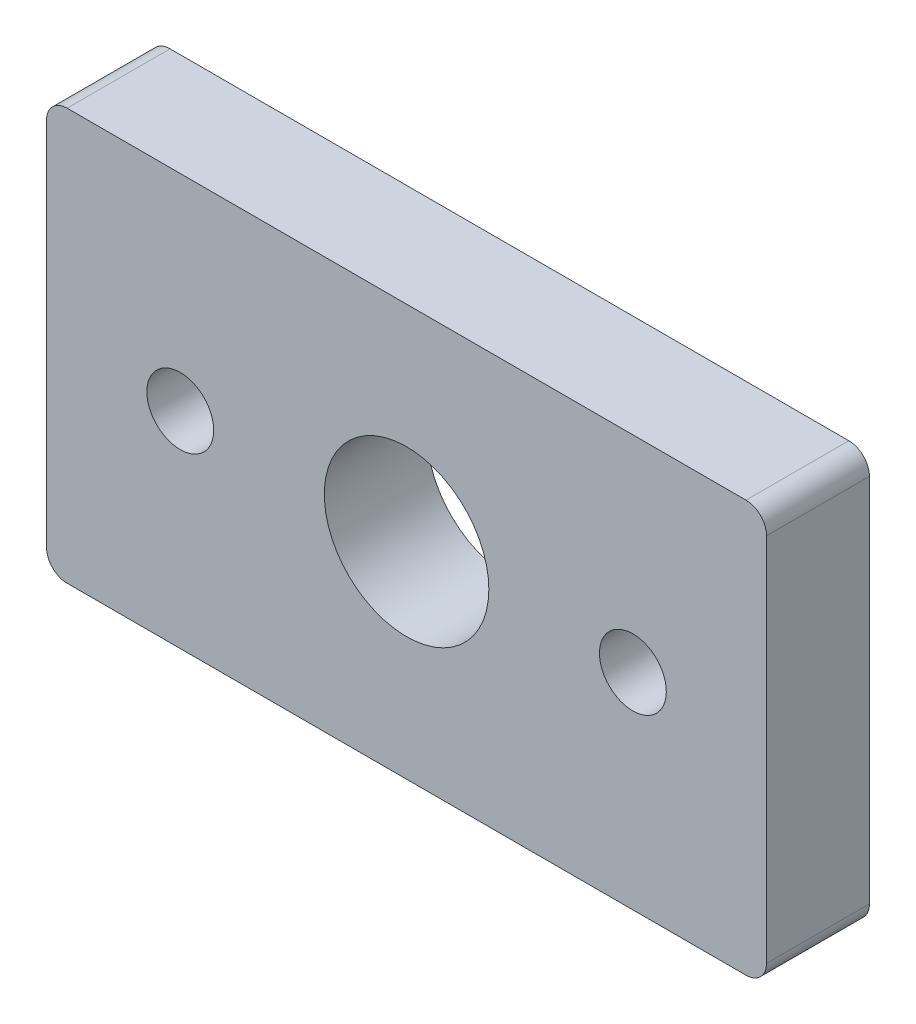
ISO-10303-21;
HEADER;
FILE_DESCRIPTION(('STEP AP214'),'2;1');
FILE_NAME('part.step','',(''),(''),'','','');
FILE_SCHEMA(('AUTOMOTIVE_DESIGN { 1 0 10303 214 1 1 1 1 }'));
ENDSEC;
DATA;
#1=APPLICATION_CONTEXT('core data for automotive mechanical design processes');
#2=APPLICATION_PROTOCOL_DEFINITION('international standard','automotive_design',2000,#1);
#3=PRODUCT_CONTEXT('',#1,'mechanical');
#4=PRODUCT('Part','Part','',(#3));
#5=PRODUCT_RELATED_PRODUCT_CATEGORY('part','',(#4));
#6=PRODUCT_DEFINITION_FORMATION('','',#4);
#7=PRODUCT_DEFINITION_CONTEXT('part definition',#1,'design');
#8=PRODUCT_DEFINITION('design','',#6,#7);
#9=PRODUCT_DEFINITION_SHAPE('','',#8);
#10=(LENGTH_UNIT() NAMED_UNIT(*) SI_UNIT(.MILLI.,.METRE.));
#11=(NAMED_UNIT(*) PLANE_ANGLE_UNIT() SI_UNIT($,.RADIAN.));
#12=(NAMED_UNIT(*) SI_UNIT($,.STERADIAN.) SOLID_ANGLE_UNIT());
#13=UNCERTAINTY_MEASURE_WITH_UNIT(LENGTH_MEASURE(1.E-05),#10,'distance_accuracy_value','');
#14=(GEOMETRIC_REPRESENTATION_CONTEXT(3) GLOBAL_UNCERTAINTY_ASSIGNED_CONTEXT((#13)) GLOBAL_UNIT_ASSIGNED_CONTEXT((#10,
#11,#12)) REPRESENTATION_CONTEXT('',''));
#15=CARTESIAN_POINT('',(0.,0.,0.));
#16=DIRECTION('',(0.,0.,1.));
#17=DIRECTION('',(1.,0.,0.));
#18=AXIS2_PLACEMENT_3D('',#15,#16,#17);
#19=CARTESIAN_POINT('',(0.,20.,5.));
#20=DIRECTION('',(0.,0.,-1.));
#21=DIRECTION('',(-1.,0.,0.));
#22=AXIS2_PLACEMENT_3D('',#19,#20,#21);
#23=PLANE('',#22);
#24=CARTESIAN_POINT('',(28.5,10.,5.));
#25=DIRECTION('',(0.,0.,1.));
#26=DIRECTION('',(1.,0.,0.));
#27=AXIS2_PLACEMENT_3D('',#24,#25,#26);
#28=CIRCLE('',#27,1.625);
#29=CARTESIAN_POINT('',(30.125,10.,5.));
#30=VERTEX_POINT('',#29);
#31=EDGE_CURVE('E180',#30,#30,#28,.T.);
#32=ORIENTED_EDGE('',*,*,#31,.F.);
#33=EDGE_LOOP('',(#32));
#34=FACE_BOUND('',#33,.T.);
#35=DIRECTION('',(1.,0.,0.));
#36=VECTOR('',#35,1.);
#37=CARTESIAN_POINT('',(0.,0.,5.));
#38=LINE('',#37,#36);
#39=CARTESIAN_POINT('',(1.,0.,5.));
#40=VERTEX_POINT('',#39);
#41=CARTESIAN_POINT('',(34.,0.,5.));
#42=VERTEX_POINT('',#41);
#43=EDGE_CURVE('E165',#40,#42,#38,.T.);
#44=ORIENTED_EDGE('',*,*,#43,.T.);
#45=CARTESIAN_POINT('',(34.,1.,5.));
#46=DIRECTION('',(0.,0.,-1.));
#47=DIRECTION('',(-1.,0.,0.));
#48=AXIS2_PLACEMENT_3D('',#45,#46,#47);
#49=CIRCLE('',#48,1.);
#50=CARTESIAN_POINT('',(35.,1.,5.));
#51=VERTEX_POINT('',#50);
#52=EDGE_CURVE('E145',#42,#51,#49,.F.);
#53=ORIENTED_EDGE('',*,*,#52,.T.);
#54=DIRECTION('',(0.,1.,0.));
#55=VECTOR('',#54,1.);
#56=CARTESIAN_POINT('',(35.,0.,5.));
#57=LINE('',#56,#55);
#58=CARTESIAN_POINT('',(35.,19.,5.));
#59=VERTEX_POINT('',#58);
#60=EDGE_CURVE('E115',#51,#59,#57,.T.);
#61=ORIENTED_EDGE('',*,*,#60,.T.);
#62=CARTESIAN_POINT('',(34.,19.,5.));
#63=DIRECTION('',(0.,0.,-1.));
#64=DIRECTION('',(-1.,0.,0.));
#65=AXIS2_PLACEMENT_3D('',#62,#63,#64);
#66=CIRCLE('',#65,1.);
#67=CARTESIAN_POINT('',(34.,20.,5.));
#68=VERTEX_POINT('',#67);
#69=EDGE_CURVE('E51',#59,#68,#66,.F.);
#70=ORIENTED_EDGE('',*,*,#69,.T.);
#71=DIRECTION('',(-1.,0.,0.));
#72=VECTOR('',#71,1.);
#73=CARTESIAN_POINT('',(0.,20.,5.));
#74=LINE('',#73,#72);
#75=CARTESIAN_POINT('',(1.,20.,5.));
#76=VERTEX_POINT('',#75);
#77=EDGE_CURVE('E132',#68,#76,#74,.T.);
#78=ORIENTED_EDGE('',*,*,#77,.T.);
#79=CARTESIAN_POINT('',(1.,19.,5.));
#80=DIRECTION('',(0.,0.,-1.));
#81=DIRECTION('',(-1.,0.,0.));
#82=AXIS2_PLACEMENT_3D('',#79,#80,#81);
#83=CIRCLE('',#82,1.);
#84=CARTESIAN_POINT('',(0.,19.,5.));
#85=VERTEX_POINT('',#84);
#86=EDGE_CURVE('E140',#76,#85,#83,.F.);
#87=ORIENTED_EDGE('',*,*,#86,.T.);
#88=DIRECTION('',(0.,-1.,0.));
#89=VECTOR('',#88,1.);
#90=CARTESIAN_POINT('',(0.,0.,5.));
#91=LINE('',#90,#89);
#92=CARTESIAN_POINT('',(0.,1.,5.));
#93=VERTEX_POINT('',#92);
#94=EDGE_CURVE('E126',#85,#93,#91,.T.);
#95=ORIENTED_EDGE('',*,*,#94,.T.);
#96=CARTESIAN_POINT('',(1.,1.,5.));
#97=DIRECTION('',(0.,0.,-1.));
#98=DIRECTION('',(-1.,0.,0.));
#99=AXIS2_PLACEMENT_3D('',#96,#97,#98);
#100=CIRCLE('',#99,1.);
#101=EDGE_CURVE('E143',#93,#40,#100,.F.);
#102=ORIENTED_EDGE('',*,*,#101,.T.);
#103=EDGE_LOOP('',(#44,#53,#61,#70,#78,#87,#95,#102));
#104=FACE_BOUND('',#103,.T.);
#105=CARTESIAN_POINT('',(17.5,10.,5.));
#106=DIRECTION('',(0.,0.,1.));
#107=DIRECTION('',(1.,0.,0.));
#108=AXIS2_PLACEMENT_3D('',#105,#106,#107);
#109=CIRCLE('',#108,4.);
#110=CARTESIAN_POINT('',(21.5,10.,5.));
#111=VERTEX_POINT('',#110);
#112=EDGE_CURVE('E171',#111,#111,#109,.T.);
#113=ORIENTED_EDGE('',*,*,#112,.F.);
#114=EDGE_LOOP('',(#113));
#115=FACE_BOUND('',#114,.T.);
#116=CARTESIAN_POINT('',(6.5,10.,5.));
#117=DIRECTION('',(0.,0.,1.));
#118=DIRECTION('',(-1.,0.,0.));
#119=AXIS2_PLACEMENT_3D('',#116,#117,#118);
#120=CIRCLE('',#119,1.625);
#121=CARTESIAN_POINT('',(4.875,10.,5.));
#122=VERTEX_POINT('',#121);
#123=EDGE_CURVE('E185',#122,#122,#120,.T.);
#124=ORIENTED_EDGE('',*,*,#123,.F.);
#125=EDGE_LOOP('',(#124));
#126=FACE_BOUND('',#125,.T.);
#127=ADVANCED_FACE('F30',(#34,#104,#115,#126),#23,.F.);
#128=CARTESIAN_POINT('',(0.,20.,0.));
#129=DIRECTION('',(0.,0.,-1.));
#130=DIRECTION('',(-1.,0.,0.));
#131=AXIS2_PLACEMENT_3D('',#128,#129,#130);
#132=PLANE('',#131);
#133=CARTESIAN_POINT('',(28.5,10.,0.));
#134=DIRECTION('',(0.,0.,1.));
#135=DIRECTION('',(1.,0.,0.));
#136=AXIS2_PLACEMENT_3D('',#133,#134,#135);
#137=CIRCLE('',#136,1.625);
#138=CARTESIAN_POINT('',(30.125,10.,0.));
#139=VERTEX_POINT('',#138);
#140=EDGE_CURVE('E182',#139,#139,#137,.T.);
#141=ORIENTED_EDGE('',*,*,#140,.T.);
#142=EDGE_LOOP('',(#141));
#143=FACE_BOUND('',#142,.T.);
#144=DIRECTION('',(0.,1.,0.));
#145=VECTOR('',#144,1.);
#146=CARTESIAN_POINT('',(35.,0.,0.));
#147=LINE('',#146,#145);
#148=CARTESIAN_POINT('',(35.,1.,0.));
#149=VERTEX_POINT('',#148);
#150=CARTESIAN_POINT('',(35.,19.,0.));
#151=VERTEX_POINT('',#150);
#152=EDGE_CURVE('E113',#149,#151,#147,.T.);
#153=ORIENTED_EDGE('',*,*,#152,.F.);
#154=CARTESIAN_POINT('',(34.,1.,0.));
#155=DIRECTION('',(0.,0.,-1.));
#156=DIRECTION('',(-1.,0.,0.));
#157=AXIS2_PLACEMENT_3D('',#154,#155,#156);
#158=CIRCLE('',#157,1.);
#159=CARTESIAN_POINT('',(34.,0.,0.));
#160=VERTEX_POINT('',#159);
#161=EDGE_CURVE('E96',#149,#160,#158,.T.);
#162=ORIENTED_EDGE('',*,*,#161,.T.);
#163=DIRECTION('',(1.,0.,0.));
#164=VECTOR('',#163,1.);
#165=CARTESIAN_POINT('',(0.,0.,0.));
#166=LINE('',#165,#164);
#167=CARTESIAN_POINT('',(1.,0.,0.));
#168=VERTEX_POINT('',#167);
#169=EDGE_CURVE('E124',#168,#160,#166,.T.);
#170=ORIENTED_EDGE('',*,*,#169,.F.);
#171=CARTESIAN_POINT('',(1.,1.,0.));
#172=DIRECTION('',(0.,0.,-1.));
#173=DIRECTION('',(-1.,0.,0.));
#174=AXIS2_PLACEMENT_3D('',#171,#172,#173);
#175=CIRCLE('',#174,1.);
#176=CARTESIAN_POINT('',(0.,1.,0.));
#177=VERTEX_POINT('',#176);
#178=EDGE_CURVE('E107',#168,#177,#175,.T.);
#179=ORIENTED_EDGE('',*,*,#178,.T.);
#180=DIRECTION('',(0.,-1.,0.));
#181=VECTOR('',#180,1.);
#182=CARTESIAN_POINT('',(0.,0.,0.));
#183=LINE('',#182,#181);
#184=CARTESIAN_POINT('',(0.,19.,0.));
#185=VERTEX_POINT('',#184);
#186=EDGE_CURVE('E128',#185,#177,#183,.T.);
#187=ORIENTED_EDGE('',*,*,#186,.F.);
#188=CARTESIAN_POINT('',(1.,19.,0.));
#189=DIRECTION('',(0.,0.,-1.));
#190=DIRECTION('',(-1.,0.,0.));
#191=AXIS2_PLACEMENT_3D('',#188,#189,#190);
#192=CIRCLE('',#191,1.);
#193=CARTESIAN_POINT('',(1.,20.,0.));
#194=VERTEX_POINT('',#193);
#195=EDGE_CURVE('E116',#185,#194,#192,.T.);
#196=ORIENTED_EDGE('',*,*,#195,.T.);
#197=DIRECTION('',(-1.,0.,0.));
#198=VECTOR('',#197,1.);
#199=CARTESIAN_POINT('',(0.,20.,0.));
#200=LINE('',#199,#198);
#201=CARTESIAN_POINT('',(34.,20.,0.));
#202=VERTEX_POINT('',#201);
#203=EDGE_CURVE('E123',#202,#194,#200,.T.);
#204=ORIENTED_EDGE('',*,*,#203,.F.);
#205=CARTESIAN_POINT('',(34.,19.,0.));
#206=DIRECTION('',(0.,0.,-1.));
#207=DIRECTION('',(-1.,0.,0.));
#208=AXIS2_PLACEMENT_3D('',#205,#206,#207);
#209=CIRCLE('',#208,1.);
#210=EDGE_CURVE('E122',#202,#151,#209,.T.);
#211=ORIENTED_EDGE('',*,*,#210,.T.);
#212=EDGE_LOOP('',(#153,#162,#170,#179,#187,#196,#204,#211));
#213=FACE_BOUND('',#212,.T.);
#214=CARTESIAN_POINT('',(17.5,10.,0.));
#215=DIRECTION('',(0.,0.,1.));
#216=DIRECTION('',(1.,0.,0.));
#217=AXIS2_PLACEMENT_3D('',#214,#215,#216);
#218=CIRCLE('',#217,4.);
#219=CARTESIAN_POINT('',(21.5,10.,0.));
#220=VERTEX_POINT('',#219);
#221=EDGE_CURVE('E173',#220,#220,#218,.T.);
#222=ORIENTED_EDGE('',*,*,#221,.T.);
#223=EDGE_LOOP('',(#222));
#224=FACE_BOUND('',#223,.T.);
#225=CARTESIAN_POINT('',(6.5,10.,0.));
#226=DIRECTION('',(0.,0.,1.));
#227=DIRECTION('',(-1.,0.,0.));
#228=AXIS2_PLACEMENT_3D('',#225,#226,#227);
#229=CIRCLE('',#228,1.625);
#230=CARTESIAN_POINT('',(4.875,10.,0.));
#231=VERTEX_POINT('',#230);
#232=EDGE_CURVE('E188',#231,#231,#229,.T.);
#233=ORIENTED_EDGE('',*,*,#232,.T.);
#234=EDGE_LOOP('',(#233));
#235=FACE_BOUND('',#234,.T.);
#236=ADVANCED_FACE('F119',(#143,#213,#224,#235),#132,.T.);
#237=CARTESIAN_POINT('',(0.,0.,5.));
#238=DIRECTION('',(1.,0.,0.));
#239=DIRECTION('',(0.,0.,-1.));
#240=AXIS2_PLACEMENT_3D('',#237,#238,#239);
#241=PLANE('',#240);
#242=ORIENTED_EDGE('',*,*,#186,.T.);
#243=DIRECTION('',(0.,0.,-1.));
#244=VECTOR('',#243,1.);
#245=CARTESIAN_POINT('',(0.,1.,5.));
#246=LINE('',#245,#244);
#247=EDGE_CURVE('E150',#177,#93,#246,.F.);
#248=ORIENTED_EDGE('',*,*,#247,.T.);
#249=ORIENTED_EDGE('',*,*,#94,.F.);
#250=DIRECTION('',(0.,0.,-1.));
#251=VECTOR('',#250,1.);
#252=CARTESIAN_POINT('',(0.,19.,5.));
#253=LINE('',#252,#251);
#254=EDGE_CURVE('E147',#85,#185,#253,.T.);
#255=ORIENTED_EDGE('',*,*,#254,.T.);
#256=EDGE_LOOP('',(#242,#248,#249,#255));
#257=FACE_BOUND('',#256,.T.);
#258=ADVANCED_FACE('F156',(#257),#241,.F.);
#259=CARTESIAN_POINT('',(0.,0.,5.));
#260=DIRECTION('',(0.,1.,0.));
#261=DIRECTION('',(0.,0.,1.));
#262=AXIS2_PLACEMENT_3D('',#259,#260,#261);
#263=PLANE('',#262);
#264=ORIENTED_EDGE('',*,*,#169,.T.);
#265=DIRECTION('',(0.,0.,-1.));
#266=VECTOR('',#265,1.);
#267=CARTESIAN_POINT('',(34.,0.,5.));
#268=LINE('',#267,#266);
#269=EDGE_CURVE('E101',#160,#42,#268,.F.);
#270=ORIENTED_EDGE('',*,*,#269,.T.);
#271=ORIENTED_EDGE('',*,*,#43,.F.);
#272=DIRECTION('',(0.,0.,-1.));
#273=VECTOR('',#272,1.);
#274=CARTESIAN_POINT('',(1.,0.,5.));
#275=LINE('',#274,#273);
#276=EDGE_CURVE('E106',#40,#168,#275,.T.);
#277=ORIENTED_EDGE('',*,*,#276,.T.);
#278=EDGE_LOOP('',(#264,#270,#271,#277));
#279=FACE_BOUND('',#278,.T.);
#280=ADVANCED_FACE('F170',(#279),#263,.F.);
#281=CARTESIAN_POINT('',(35.,0.,5.));
#282=DIRECTION('',(-1.,0.,0.));
#283=DIRECTION('',(0.,0.,1.));
#284=AXIS2_PLACEMENT_3D('',#281,#282,#283);
#285=PLANE('',#284);
#286=ORIENTED_EDGE('',*,*,#60,.F.);
#287=DIRECTION('',(0.,0.,-1.));
#288=VECTOR('',#287,1.);
#289=CARTESIAN_POINT('',(35.,1.,5.));
#290=LINE('',#289,#288);
#291=EDGE_CURVE('E100',#51,#149,#290,.T.);
#292=ORIENTED_EDGE('',*,*,#291,.T.);
#293=ORIENTED_EDGE('',*,*,#152,.T.);
#294=DIRECTION('',(0.,0.,-1.));
#295=VECTOR('',#294,1.);
#296=CARTESIAN_POINT('',(35.,19.,5.));
#297=LINE('',#296,#295);
#298=EDGE_CURVE('E117',#151,#59,#297,.F.);
#299=ORIENTED_EDGE('',*,*,#298,.T.);
#300=EDGE_LOOP('',(#286,#292,#293,#299));
#301=FACE_BOUND('',#300,.T.);
#302=ADVANCED_FACE('F112',(#301),#285,.F.);
#303=CARTESIAN_POINT('',(0.,20.,5.));
#304=DIRECTION('',(0.,-1.,0.));
#305=DIRECTION('',(0.,0.,-1.));
#306=AXIS2_PLACEMENT_3D('',#303,#304,#305);
#307=PLANE('',#306);
#308=ORIENTED_EDGE('',*,*,#77,.F.);
#309=DIRECTION('',(0.,0.,-1.));
#310=VECTOR('',#309,1.);
#311=CARTESIAN_POINT('',(34.,20.,5.));
#312=LINE('',#311,#310);
#313=EDGE_CURVE('E11',#68,#202,#312,.T.);
#314=ORIENTED_EDGE('',*,*,#313,.T.);
#315=ORIENTED_EDGE('',*,*,#203,.T.);
#316=DIRECTION('',(0.,0.,-1.));
#317=VECTOR('',#316,1.);
#318=CARTESIAN_POINT('',(1.,20.,5.));
#319=LINE('',#318,#317);
#320=EDGE_CURVE('E38',#194,#76,#319,.F.);
#321=ORIENTED_EDGE('',*,*,#320,.T.);
#322=EDGE_LOOP('',(#308,#314,#315,#321));
#323=FACE_BOUND('',#322,.T.);
#324=ADVANCED_FACE('F210',(#323),#307,.F.);
#325=CARTESIAN_POINT('',(17.5,10.,5.));
#326=DIRECTION('',(0.,0.,-1.));
#327=DIRECTION('',(-1.,0.,0.));
#328=AXIS2_PLACEMENT_3D('',#325,#326,#327);
#329=CYLINDRICAL_SURFACE('',#328,4.);
#330=ORIENTED_EDGE('',*,*,#112,.T.);
#331=EDGE_LOOP('',(#330));
#332=FACE_BOUND('',#331,.T.);
#333=ORIENTED_EDGE('',*,*,#221,.F.);
#334=EDGE_LOOP('',(#333));
#335=FACE_BOUND('',#334,.T.);
#336=ADVANCED_FACE('F207',(#332,#335),#329,.F.);
#337=CARTESIAN_POINT('',(28.5,10.,5.));
#338=DIRECTION('',(0.,0.,-1.));
#339=DIRECTION('',(-1.,0.,0.));
#340=AXIS2_PLACEMENT_3D('',#337,#338,#339);
#341=CYLINDRICAL_SURFACE('',#340,1.625);
#342=ORIENTED_EDGE('',*,*,#31,.T.);
#343=EDGE_LOOP('',(#342));
#344=FACE_BOUND('',#343,.T.);
#345=ORIENTED_EDGE('',*,*,#140,.F.);
#346=EDGE_LOOP('',(#345));
#347=FACE_BOUND('',#346,.T.);
#348=ADVANCED_FACE('F293',(#344,#347),#341,.F.);
#349=CARTESIAN_POINT('',(6.5,10.,5.));
#350=DIRECTION('',(0.,0.,-1.));
#351=DIRECTION('',(-1.,0.,0.));
#352=AXIS2_PLACEMENT_3D('',#349,#350,#351);
#353=CYLINDRICAL_SURFACE('',#352,1.625);
#354=ORIENTED_EDGE('',*,*,#123,.T.);
#355=EDGE_LOOP('',(#354));
#356=FACE_BOUND('',#355,.T.);
#357=ORIENTED_EDGE('',*,*,#232,.F.);
#358=EDGE_LOOP('',(#357));
#359=FACE_BOUND('',#358,.T.);
#360=ADVANCED_FACE('F194',(#356,#359),#353,.F.);
#361=CARTESIAN_POINT('',(34.,1.,5.));
#362=DIRECTION('',(0.,0.,-1.));
#363=DIRECTION('',(-1.,0.,0.));
#364=AXIS2_PLACEMENT_3D('',#361,#362,#363);
#365=CYLINDRICAL_SURFACE('',#364,1.);
#366=ORIENTED_EDGE('',*,*,#52,.F.);
#367=ORIENTED_EDGE('',*,*,#269,.F.);
#368=ORIENTED_EDGE('',*,*,#161,.F.);
#369=ORIENTED_EDGE('',*,*,#291,.F.);
#370=EDGE_LOOP('',(#366,#367,#368,#369));
#371=FACE_BOUND('',#370,.T.);
#372=ADVANCED_FACE('F99',(#371),#365,.T.);
#373=CARTESIAN_POINT('',(1.,1.,5.));
#374=DIRECTION('',(0.,0.,-1.));
#375=DIRECTION('',(-1.,0.,0.));
#376=AXIS2_PLACEMENT_3D('',#373,#374,#375);
#377=CYLINDRICAL_SURFACE('',#376,1.);
#378=ORIENTED_EDGE('',*,*,#101,.F.);
#379=ORIENTED_EDGE('',*,*,#247,.F.);
#380=ORIENTED_EDGE('',*,*,#178,.F.);
#381=ORIENTED_EDGE('',*,*,#276,.F.);
#382=EDGE_LOOP('',(#378,#379,#380,#381));
#383=FACE_BOUND('',#382,.T.);
#384=ADVANCED_FACE('F168',(#383),#377,.T.);
#385=CARTESIAN_POINT('',(34.,19.,5.));
#386=DIRECTION('',(0.,0.,-1.));
#387=DIRECTION('',(-1.,0.,0.));
#388=AXIS2_PLACEMENT_3D('',#385,#386,#387);
#389=CYLINDRICAL_SURFACE('',#388,1.);
#390=ORIENTED_EDGE('',*,*,#69,.F.);
#391=ORIENTED_EDGE('',*,*,#298,.F.);
#392=ORIENTED_EDGE('',*,*,#210,.F.);
#393=ORIENTED_EDGE('',*,*,#313,.F.);
#394=EDGE_LOOP('',(#390,#391,#392,#393));
#395=FACE_BOUND('',#394,.T.);
#396=ADVANCED_FACE('F222',(#395),#389,.T.);
#397=CARTESIAN_POINT('',(1.,19.,5.));
#398=DIRECTION('',(0.,0.,-1.));
#399=DIRECTION('',(-1.,0.,0.));
#400=AXIS2_PLACEMENT_3D('',#397,#398,#399);
#401=CYLINDRICAL_SURFACE('',#400,1.);
#402=ORIENTED_EDGE('',*,*,#86,.F.);
#403=ORIENTED_EDGE('',*,*,#320,.F.);
#404=ORIENTED_EDGE('',*,*,#195,.F.);
#405=ORIENTED_EDGE('',*,*,#254,.F.);
#406=EDGE_LOOP('',(#402,#403,#404,#405));
#407=FACE_BOUND('',#406,.T.);
#408=ADVANCED_FACE('F32',(#407),#401,.T.);
#409=CLOSED_SHELL('',(#127,#236,#258,#280,#302,#324,#336,#348,#360,#372,#384,#396,#408));
#410=MANIFOLD_SOLID_BREP('B2',#409);
#411=ADVANCED_BREP_SHAPE_REPRESENTATION('',(#18,#410),#14);
#412=SHAPE_DEFINITION_REPRESENTATION(#9,#411);
ENDSEC;
END-ISO-10303-21;
